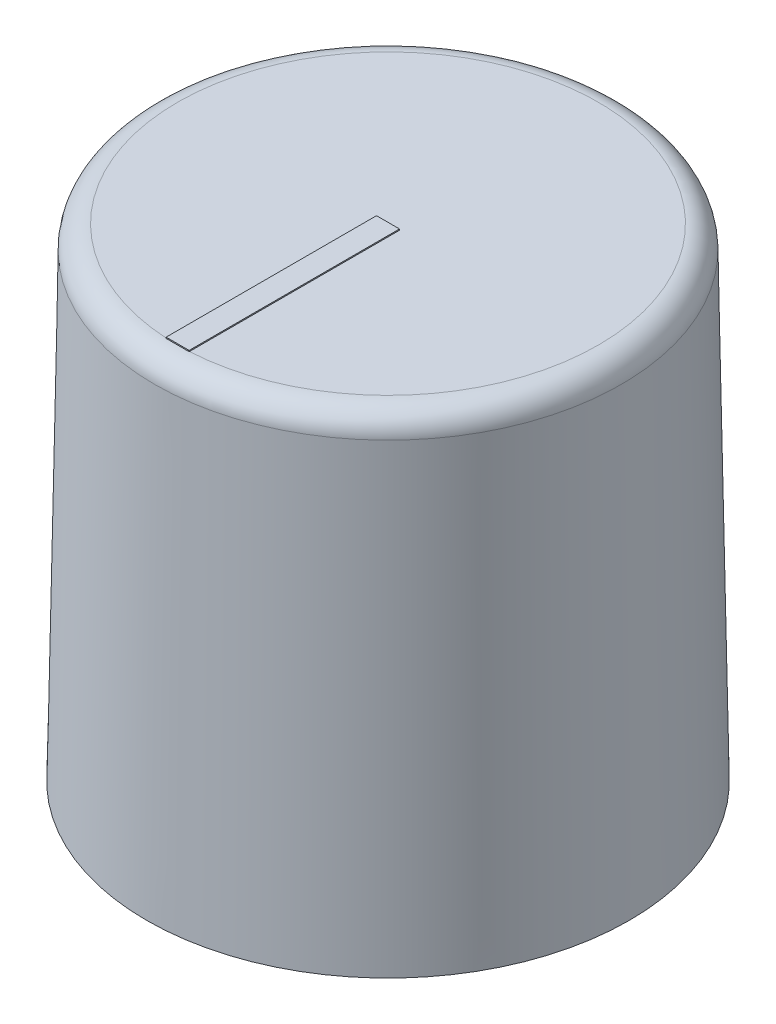
ISO-10303-21;
HEADER;
FILE_DESCRIPTION(('STEP AP214'),'2;1');
FILE_NAME('part.step','',(''),(''),'','','');
FILE_SCHEMA(('AUTOMOTIVE_DESIGN { 1 0 10303 214 1 1 1 1 }'));
ENDSEC;
DATA;
#1=APPLICATION_CONTEXT('core data for automotive mechanical design processes');
#2=APPLICATION_PROTOCOL_DEFINITION('international standard','automotive_design',2000,#1);
#3=PRODUCT_CONTEXT('',#1,'mechanical');
#4=PRODUCT('Part','Part','',(#3));
#5=PRODUCT_RELATED_PRODUCT_CATEGORY('part','',(#4));
#6=PRODUCT_DEFINITION_FORMATION('','',#4);
#7=PRODUCT_DEFINITION_CONTEXT('part definition',#1,'design');
#8=PRODUCT_DEFINITION('design','',#6,#7);
#9=PRODUCT_DEFINITION_SHAPE('','',#8);
#10=(LENGTH_UNIT() NAMED_UNIT(*) SI_UNIT(.MILLI.,.METRE.));
#11=(NAMED_UNIT(*) PLANE_ANGLE_UNIT() SI_UNIT($,.RADIAN.));
#12=(NAMED_UNIT(*) SI_UNIT($,.STERADIAN.) SOLID_ANGLE_UNIT());
#13=UNCERTAINTY_MEASURE_WITH_UNIT(LENGTH_MEASURE(1.E-05),#10,'distance_accuracy_value','');
#14=(GEOMETRIC_REPRESENTATION_CONTEXT(3) GLOBAL_UNCERTAINTY_ASSIGNED_CONTEXT((#13)) GLOBAL_UNIT_ASSIGNED_CONTEXT((#10,
#11,#12)) REPRESENTATION_CONTEXT('',''));
#15=CARTESIAN_POINT('',(0.,0.,0.));
#16=DIRECTION('',(0.,0.,1.));
#17=DIRECTION('',(1.,0.,0.));
#18=AXIS2_PLACEMENT_3D('',#15,#16,#17);
#19=CARTESIAN_POINT('',(0.,21.,0.));
#20=DIRECTION('',(0.,1.,0.));
#21=DIRECTION('',(0.,0.,1.));
#22=AXIS2_PLACEMENT_3D('',#19,#20,#21);
#23=PLANE('',#22);
#24=CARTESIAN_POINT('',(0.,21.,0.));
#25=DIRECTION('',(0.,1.,0.));
#26=DIRECTION('',(0.,0.,1.));
#27=AXIS2_PLACEMENT_3D('',#24,#25,#26);
#28=CIRCLE('',#27,9.15074637339174);
#29=CARTESIAN_POINT('',(0.5,21.,9.13707607444209));
#30=VERTEX_POINT('',#29);
#31=CARTESIAN_POINT('',(-0.5,21.,9.13707607444209));
#32=VERTEX_POINT('',#31);
#33=EDGE_CURVE('E132',#30,#32,#28,.T.);
#34=ORIENTED_EDGE('',*,*,#33,.T.);
#35=DIRECTION('',(0.,0.,1.));
#36=VECTOR('',#35,1.);
#37=CARTESIAN_POINT('',(-0.5,21.,9.15074637339174));
#38=LINE('',#37,#36);
#39=CARTESIAN_POINT('',(-0.5,21.,0.));
#40=VERTEX_POINT('',#39);
#41=EDGE_CURVE('E62',#40,#32,#38,.T.);
#42=ORIENTED_EDGE('',*,*,#41,.F.);
#43=DIRECTION('',(-1.,0.,0.));
#44=VECTOR('',#43,1.);
#45=CARTESIAN_POINT('',(-0.5,21.,0.));
#46=LINE('',#45,#44);
#47=CARTESIAN_POINT('',(0.5,21.,0.));
#48=VERTEX_POINT('',#47);
#49=EDGE_CURVE('E57',#48,#40,#46,.T.);
#50=ORIENTED_EDGE('',*,*,#49,.F.);
#51=DIRECTION('',(0.,0.,-1.));
#52=VECTOR('',#51,1.);
#53=CARTESIAN_POINT('',(0.5,21.,9.15074637339174));
#54=LINE('',#53,#52);
#55=EDGE_CURVE('E146',#30,#48,#54,.T.);
#56=ORIENTED_EDGE('',*,*,#55,.F.);
#57=EDGE_LOOP('',(#34,#42,#50,#56));
#58=FACE_BOUND('',#57,.T.);
#59=ADVANCED_FACE('F42',(#58),#23,.T.);
#60=CARTESIAN_POINT('',(0.,0.,0.));
#61=DIRECTION('',(0.,-1.,0.));
#62=DIRECTION('',(0.,0.,1.));
#63=AXIS2_PLACEMENT_3D('',#60,#61,#62);
#64=CONICAL_SURFACE('',#63,10.5,0.0174532925199433);
#65=CARTESIAN_POINT('',(0.,20.0174524064373,0.));
#66=DIRECTION('',(0.,-1.,0.));
#67=DIRECTION('',(0.,0.,-1.));
#68=AXIS2_PLACEMENT_3D('',#65,#66,#67);
#69=CIRCLE('',#68,10.1505940685481);
#70=CARTESIAN_POINT('',(0.,20.0174524064373,-10.1505940685481));
#71=VERTEX_POINT('',#70);
#72=EDGE_CURVE('E12',#71,#71,#69,.T.);
#73=ORIENTED_EDGE('',*,*,#72,.T.);
#74=EDGE_LOOP('',(#73));
#75=FACE_BOUND('',#74,.T.);
#76=CARTESIAN_POINT('',(0.,0.,0.));
#77=DIRECTION('',(0.,1.,0.));
#78=DIRECTION('',(0.,0.,1.));
#79=AXIS2_PLACEMENT_3D('',#76,#77,#78);
#80=CIRCLE('',#79,10.5);
#81=CARTESIAN_POINT('',(0.,0.,10.5));
#82=VERTEX_POINT('',#81);
#83=EDGE_CURVE('E128',#82,#82,#80,.T.);
#84=ORIENTED_EDGE('',*,*,#83,.T.);
#85=EDGE_LOOP('',(#84));
#86=FACE_BOUND('',#85,.T.);
#87=ADVANCED_FACE('F172',(#75,#86),#64,.T.);
#88=CARTESIAN_POINT('',(0.,0.,0.));
#89=DIRECTION('',(0.,1.,0.));
#90=DIRECTION('',(0.,0.,1.));
#91=AXIS2_PLACEMENT_3D('',#88,#89,#90);
#92=PLANE('',#91);
#93=CARTESIAN_POINT('',(0.,0.,0.));
#94=DIRECTION('',(0.,-1.,0.));
#95=DIRECTION('',(0.,0.,-1.));
#96=AXIS2_PLACEMENT_3D('',#93,#94,#95);
#97=CIRCLE('',#96,9.);
#98=CARTESIAN_POINT('',(0.,0.,-9.));
#99=VERTEX_POINT('',#98);
#100=EDGE_CURVE('E117',#99,#99,#97,.T.);
#101=ORIENTED_EDGE('',*,*,#100,.F.);
#102=EDGE_LOOP('',(#101));
#103=FACE_BOUND('',#102,.T.);
#104=ORIENTED_EDGE('',*,*,#83,.F.);
#105=EDGE_LOOP('',(#104));
#106=FACE_BOUND('',#105,.T.);
#107=ADVANCED_FACE('F177',(#103,#106),#92,.F.);
#108=CARTESIAN_POINT('',(0.,20.,0.));
#109=DIRECTION('',(0.,1.,0.));
#110=DIRECTION('',(0.,0.,1.));
#111=AXIS2_PLACEMENT_3D('',#108,#109,#110);
#112=PLANE('',#111);
#113=CARTESIAN_POINT('',(0.,20.,0.));
#114=DIRECTION('',(0.,1.,0.));
#115=DIRECTION('',(0.,0.,1.));
#116=AXIS2_PLACEMENT_3D('',#113,#114,#115);
#117=CIRCLE('',#116,9.);
#118=CARTESIAN_POINT('',(0.,20.,9.));
#119=VERTEX_POINT('',#118);
#120=EDGE_CURVE('E120',#119,#119,#117,.F.);
#121=ORIENTED_EDGE('',*,*,#120,.T.);
#122=EDGE_LOOP('',(#121));
#123=FACE_BOUND('',#122,.T.);
#124=ADVANCED_FACE('F167',(#123),#112,.F.);
#125=CARTESIAN_POINT('',(0.,46.4558441227157,0.));
#126=DIRECTION('',(0.,-1.,0.));
#127=DIRECTION('',(0.,0.,-1.));
#128=AXIS2_PLACEMENT_3D('',#125,#126,#127);
#129=CYLINDRICAL_SURFACE('',#128,9.);
#130=ORIENTED_EDGE('',*,*,#100,.T.);
#131=EDGE_LOOP('',(#130));
#132=FACE_BOUND('',#131,.T.);
#133=ORIENTED_EDGE('',*,*,#120,.F.);
#134=EDGE_LOOP('',(#133));
#135=FACE_BOUND('',#134,.T.);
#136=ADVANCED_FACE('F160',(#132,#135),#129,.F.);
#137=CARTESIAN_POINT('',(0.,20.,0.));
#138=DIRECTION('',(0.,1.,0.));
#139=DIRECTION('',(0.,0.,1.));
#140=AXIS2_PLACEMENT_3D('',#137,#138,#139);
#141=TOROIDAL_SURFACE('',#140,9.15074637339174,1.);
#142=ORIENTED_EDGE('',*,*,#72,.F.);
#143=EDGE_LOOP('',(#142));
#144=FACE_BOUND('',#143,.T.);
#145=CARTESIAN_POINT('',(0.,21.,9.15074637339174));
#146=VERTEX_POINT('',#145);
#147=EDGE_CURVE('E50',#146,#30,#28,.T.);
#148=ORIENTED_EDGE('',*,*,#147,.F.);
#149=EDGE_CURVE('E130',#32,#146,#28,.T.);
#150=ORIENTED_EDGE('',*,*,#149,.F.);
#151=ORIENTED_EDGE('',*,*,#33,.F.);
#152=EDGE_LOOP('',(#148,#150,#151));
#153=FACE_BOUND('',#152,.T.);
#154=ADVANCED_FACE('F44',(#144,#153),#141,.T.);
#155=CARTESIAN_POINT('',(0.,21.,0.));
#156=DIRECTION('',(0.,-1.,0.));
#157=DIRECTION('',(0.,0.,-1.));
#158=AXIS2_PLACEMENT_3D('',#155,#156,#157);
#159=PLANE('',#158);
#160=ORIENTED_EDGE('',*,*,#149,.T.);
#161=DIRECTION('',(1.,0.,0.));
#162=VECTOR('',#161,1.);
#163=CARTESIAN_POINT('',(-0.5,21.,9.15074637339174));
#164=LINE('',#163,#162);
#165=CARTESIAN_POINT('',(-0.5,21.,9.15074637339174));
#166=VERTEX_POINT('',#165);
#167=EDGE_CURVE('E140',#166,#146,#164,.T.);
#168=ORIENTED_EDGE('',*,*,#167,.F.);
#169=EDGE_CURVE('E115',#32,#166,#38,.T.);
#170=ORIENTED_EDGE('',*,*,#169,.F.);
#171=EDGE_LOOP('',(#160,#168,#170));
#172=FACE_BOUND('',#171,.T.);
#173=ADVANCED_FACE('F139',(#172),#159,.T.);
#174=CARTESIAN_POINT('',(-0.5,21.05,9.15074637339174));
#175=DIRECTION('',(1.,0.,0.));
#176=DIRECTION('',(0.,0.,-1.));
#177=AXIS2_PLACEMENT_3D('',#174,#175,#176);
#178=PLANE('',#177);
#179=ORIENTED_EDGE('',*,*,#41,.T.);
#180=ORIENTED_EDGE('',*,*,#169,.T.);
#181=DIRECTION('',(0.,-1.,0.));
#182=VECTOR('',#181,1.);
#183=CARTESIAN_POINT('',(-0.5,21.05,9.15074637339174));
#184=LINE('',#183,#182);
#185=CARTESIAN_POINT('',(-0.5,21.05,9.15074637339174));
#186=VERTEX_POINT('',#185);
#187=EDGE_CURVE('E97',#186,#166,#184,.T.);
#188=ORIENTED_EDGE('',*,*,#187,.F.);
#189=DIRECTION('',(0.,0.,1.));
#190=VECTOR('',#189,1.);
#191=CARTESIAN_POINT('',(-0.5,21.05,9.15074637339174));
#192=LINE('',#191,#190);
#193=CARTESIAN_POINT('',(-0.5,21.05,0.));
#194=VERTEX_POINT('',#193);
#195=EDGE_CURVE('E103',#194,#186,#192,.T.);
#196=ORIENTED_EDGE('',*,*,#195,.F.);
#197=DIRECTION('',(0.,-1.,0.));
#198=VECTOR('',#197,1.);
#199=CARTESIAN_POINT('',(-0.5,21.05,0.));
#200=LINE('',#199,#198);
#201=EDGE_CURVE('E152',#194,#40,#200,.T.);
#202=ORIENTED_EDGE('',*,*,#201,.T.);
#203=EDGE_LOOP('',(#179,#180,#188,#196,#202));
#204=FACE_BOUND('',#203,.T.);
#205=ADVANCED_FACE('F113',(#204),#178,.F.);
#206=CARTESIAN_POINT('',(-0.5,21.05,9.15074637339174));
#207=DIRECTION('',(0.,0.,-1.));
#208=DIRECTION('',(-1.,0.,0.));
#209=AXIS2_PLACEMENT_3D('',#206,#207,#208);
#210=PLANE('',#209);
#211=ORIENTED_EDGE('',*,*,#167,.T.);
#212=CARTESIAN_POINT('',(0.5,21.,9.15074637339174));
#213=VERTEX_POINT('',#212);
#214=EDGE_CURVE('E142',#146,#213,#164,.T.);
#215=ORIENTED_EDGE('',*,*,#214,.T.);
#216=DIRECTION('',(0.,-1.,0.));
#217=VECTOR('',#216,1.);
#218=CARTESIAN_POINT('',(0.5,21.05,9.15074637339174));
#219=LINE('',#218,#217);
#220=CARTESIAN_POINT('',(0.5,21.05,9.15074637339174));
#221=VERTEX_POINT('',#220);
#222=EDGE_CURVE('E99',#221,#213,#219,.T.);
#223=ORIENTED_EDGE('',*,*,#222,.F.);
#224=DIRECTION('',(1.,0.,0.));
#225=VECTOR('',#224,1.);
#226=CARTESIAN_POINT('',(-0.5,21.05,9.15074637339174));
#227=LINE('',#226,#225);
#228=EDGE_CURVE('E92',#186,#221,#227,.T.);
#229=ORIENTED_EDGE('',*,*,#228,.F.);
#230=ORIENTED_EDGE('',*,*,#187,.T.);
#231=EDGE_LOOP('',(#211,#215,#223,#229,#230));
#232=FACE_BOUND('',#231,.T.);
#233=ADVANCED_FACE('F95',(#232),#210,.F.);
#234=CARTESIAN_POINT('',(0.5,21.05,9.15074637339174));
#235=DIRECTION('',(-1.,0.,0.));
#236=DIRECTION('',(0.,0.,1.));
#237=AXIS2_PLACEMENT_3D('',#234,#235,#236);
#238=PLANE('',#237);
#239=EDGE_CURVE('E144',#213,#30,#54,.T.);
#240=ORIENTED_EDGE('',*,*,#239,.T.);
#241=ORIENTED_EDGE('',*,*,#55,.T.);
#242=DIRECTION('',(0.,-1.,0.));
#243=VECTOR('',#242,1.);
#244=CARTESIAN_POINT('',(0.5,21.05,0.));
#245=LINE('',#244,#243);
#246=CARTESIAN_POINT('',(0.5,21.05,0.));
#247=VERTEX_POINT('',#246);
#248=EDGE_CURVE('E122',#247,#48,#245,.T.);
#249=ORIENTED_EDGE('',*,*,#248,.F.);
#250=DIRECTION('',(0.,0.,-1.));
#251=VECTOR('',#250,1.);
#252=CARTESIAN_POINT('',(0.5,21.05,9.15074637339174));
#253=LINE('',#252,#251);
#254=EDGE_CURVE('E102',#221,#247,#253,.T.);
#255=ORIENTED_EDGE('',*,*,#254,.F.);
#256=ORIENTED_EDGE('',*,*,#222,.T.);
#257=EDGE_LOOP('',(#240,#241,#249,#255,#256));
#258=FACE_BOUND('',#257,.T.);
#259=ADVANCED_FACE('F158',(#258),#238,.F.);
#260=CARTESIAN_POINT('',(-0.5,21.05,0.));
#261=DIRECTION('',(0.,0.,1.));
#262=DIRECTION('',(1.,0.,0.));
#263=AXIS2_PLACEMENT_3D('',#260,#261,#262);
#264=PLANE('',#263);
#265=ORIENTED_EDGE('',*,*,#49,.T.);
#266=ORIENTED_EDGE('',*,*,#201,.F.);
#267=DIRECTION('',(-1.,0.,0.));
#268=VECTOR('',#267,1.);
#269=CARTESIAN_POINT('',(-0.5,21.05,0.));
#270=LINE('',#269,#268);
#271=EDGE_CURVE('E108',#247,#194,#270,.T.);
#272=ORIENTED_EDGE('',*,*,#271,.F.);
#273=ORIENTED_EDGE('',*,*,#248,.T.);
#274=EDGE_LOOP('',(#265,#266,#272,#273));
#275=FACE_BOUND('',#274,.T.);
#276=ADVANCED_FACE('F156',(#275),#264,.F.);
#277=CARTESIAN_POINT('',(0.,21.05,0.));
#278=DIRECTION('',(0.,-1.,0.));
#279=DIRECTION('',(0.,0.,-1.));
#280=AXIS2_PLACEMENT_3D('',#277,#278,#279);
#281=PLANE('',#280);
#282=ORIENTED_EDGE('',*,*,#195,.T.);
#283=ORIENTED_EDGE('',*,*,#228,.T.);
#284=ORIENTED_EDGE('',*,*,#254,.T.);
#285=ORIENTED_EDGE('',*,*,#271,.T.);
#286=EDGE_LOOP('',(#282,#283,#284,#285));
#287=FACE_BOUND('',#286,.T.);
#288=ADVANCED_FACE('F106',(#287),#281,.F.);
#289=ORIENTED_EDGE('',*,*,#147,.T.);
#290=ORIENTED_EDGE('',*,*,#239,.F.);
#291=ORIENTED_EDGE('',*,*,#214,.F.);
#292=EDGE_LOOP('',(#289,#290,#291));
#293=FACE_BOUND('',#292,.T.);
#294=ADVANCED_FACE('F143',(#293),#159,.T.);
#295=CLOSED_SHELL('',(#59,#87,#107,#124,#136,#154,#173,#205,#233,#259,#276,#288,#294));
#296=MANIFOLD_SOLID_BREP('B2',#295);
#297=ADVANCED_BREP_SHAPE_REPRESENTATION('',(#18,#296),#14);
#298=SHAPE_DEFINITION_REPRESENTATION(#9,#297);
ENDSEC;
END-ISO-10303-21;
